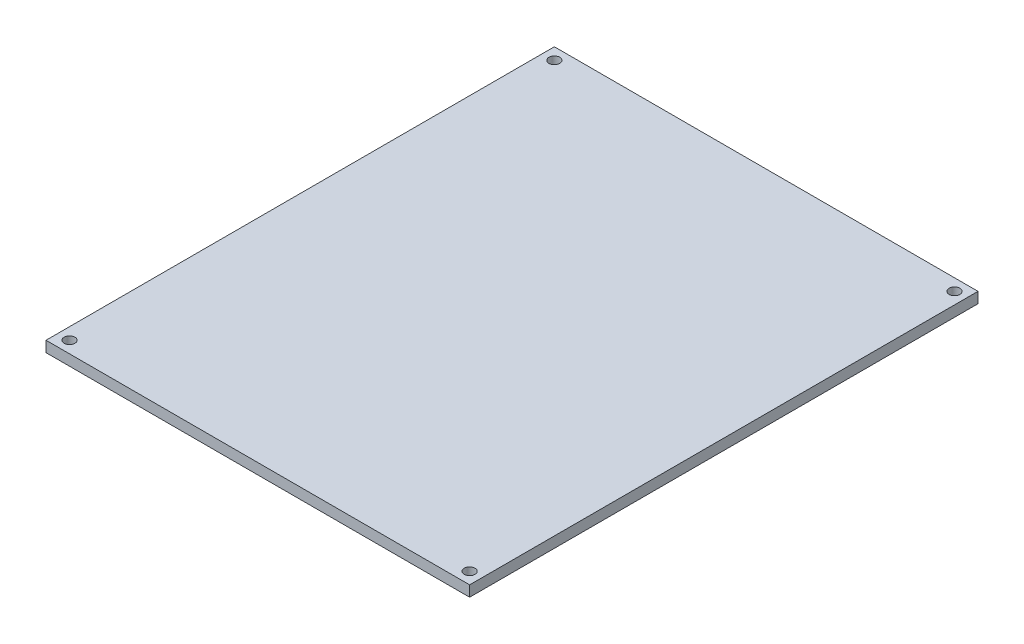
ISO-10303-21;
HEADER;
FILE_DESCRIPTION(('STEP AP214'),'2;1');
FILE_NAME('part.step','',(''),(''),'','','');
FILE_SCHEMA(('AUTOMOTIVE_DESIGN { 1 0 10303 214 1 1 1 1 }'));
ENDSEC;
DATA;
#1=APPLICATION_CONTEXT('core data for automotive mechanical design processes');
#2=APPLICATION_PROTOCOL_DEFINITION('international standard','automotive_design',2000,#1);
#3=PRODUCT_CONTEXT('',#1,'mechanical');
#4=PRODUCT('Part','Part','',(#3));
#5=PRODUCT_RELATED_PRODUCT_CATEGORY('part','',(#4));
#6=PRODUCT_DEFINITION_FORMATION('','',#4);
#7=PRODUCT_DEFINITION_CONTEXT('part definition',#1,'design');
#8=PRODUCT_DEFINITION('design','',#6,#7);
#9=PRODUCT_DEFINITION_SHAPE('','',#8);
#10=(LENGTH_UNIT() NAMED_UNIT(*) SI_UNIT(.MILLI.,.METRE.));
#11=(NAMED_UNIT(*) PLANE_ANGLE_UNIT() SI_UNIT($,.RADIAN.));
#12=(NAMED_UNIT(*) SI_UNIT($,.STERADIAN.) SOLID_ANGLE_UNIT());
#13=UNCERTAINTY_MEASURE_WITH_UNIT(LENGTH_MEASURE(1.E-05),#10,'distance_accuracy_value','');
#14=(GEOMETRIC_REPRESENTATION_CONTEXT(3) GLOBAL_UNCERTAINTY_ASSIGNED_CONTEXT((#13)) GLOBAL_UNIT_ASSIGNED_CONTEXT((#10,
#11,#12)) REPRESENTATION_CONTEXT('',''));
#15=CARTESIAN_POINT('',(0.,0.,0.));
#16=DIRECTION('',(0.,0.,1.));
#17=DIRECTION('',(1.,0.,0.));
#18=AXIS2_PLACEMENT_3D('',#15,#16,#17);
#19=CARTESIAN_POINT('',(0.,2.54,0.));
#20=DIRECTION('',(1.,0.,0.));
#21=DIRECTION('',(0.,0.,-1.));
#22=AXIS2_PLACEMENT_3D('',#19,#20,#21);
#23=PLANE('',#22);
#24=DIRECTION('',(0.,0.,1.));
#25=VECTOR('',#24,1.);
#26=CARTESIAN_POINT('',(0.,0.,0.));
#27=LINE('',#26,#25);
#28=CARTESIAN_POINT('',(0.,0.,-120.));
#29=VERTEX_POINT('',#28);
#30=CARTESIAN_POINT('',(0.,0.,0.));
#31=VERTEX_POINT('',#30);
#32=EDGE_CURVE('E107',#29,#31,#27,.T.);
#33=ORIENTED_EDGE('',*,*,#32,.T.);
#34=DIRECTION('',(0.,-1.,0.));
#35=VECTOR('',#34,1.);
#36=CARTESIAN_POINT('',(0.,2.54,0.));
#37=LINE('',#36,#35);
#38=CARTESIAN_POINT('',(0.,2.54,0.));
#39=VERTEX_POINT('',#38);
#40=EDGE_CURVE('E11',#39,#31,#37,.T.);
#41=ORIENTED_EDGE('',*,*,#40,.F.);
#42=DIRECTION('',(0.,0.,1.));
#43=VECTOR('',#42,1.);
#44=CARTESIAN_POINT('',(0.,2.54,0.));
#45=LINE('',#44,#43);
#46=CARTESIAN_POINT('',(0.,2.54,-120.));
#47=VERTEX_POINT('',#46);
#48=EDGE_CURVE('E91',#47,#39,#45,.T.);
#49=ORIENTED_EDGE('',*,*,#48,.F.);
#50=DIRECTION('',(0.,-1.,0.));
#51=VECTOR('',#50,1.);
#52=CARTESIAN_POINT('',(0.,2.54,-120.));
#53=LINE('',#52,#51);
#54=EDGE_CURVE('E103',#47,#29,#53,.T.);
#55=ORIENTED_EDGE('',*,*,#54,.T.);
#56=EDGE_LOOP('',(#33,#41,#49,#55));
#57=FACE_BOUND('',#56,.T.);
#58=ADVANCED_FACE('F39',(#57),#23,.F.);
#59=CARTESIAN_POINT('',(0.,2.54,0.));
#60=DIRECTION('',(0.,0.,-1.));
#61=DIRECTION('',(-1.,0.,0.));
#62=AXIS2_PLACEMENT_3D('',#59,#60,#61);
#63=PLANE('',#62);
#64=DIRECTION('',(1.,0.,0.));
#65=VECTOR('',#64,1.);
#66=CARTESIAN_POINT('',(0.,0.,0.));
#67=LINE('',#66,#65);
#68=CARTESIAN_POINT('',(100.,0.,0.));
#69=VERTEX_POINT('',#68);
#70=EDGE_CURVE('E96',#31,#69,#67,.T.);
#71=ORIENTED_EDGE('',*,*,#70,.T.);
#72=DIRECTION('',(0.,-1.,0.));
#73=VECTOR('',#72,1.);
#74=CARTESIAN_POINT('',(100.,2.54,0.));
#75=LINE('',#74,#73);
#76=CARTESIAN_POINT('',(100.,2.54,0.));
#77=VERTEX_POINT('',#76);
#78=EDGE_CURVE('E48',#77,#69,#75,.T.);
#79=ORIENTED_EDGE('',*,*,#78,.F.);
#80=DIRECTION('',(1.,0.,0.));
#81=VECTOR('',#80,1.);
#82=CARTESIAN_POINT('',(0.,2.54,0.));
#83=LINE('',#82,#81);
#84=EDGE_CURVE('E86',#39,#77,#83,.T.);
#85=ORIENTED_EDGE('',*,*,#84,.F.);
#86=ORIENTED_EDGE('',*,*,#40,.T.);
#87=EDGE_LOOP('',(#71,#79,#85,#86));
#88=FACE_BOUND('',#87,.T.);
#89=ADVANCED_FACE('F95',(#88),#63,.F.);
#90=CARTESIAN_POINT('',(100.,2.54,0.));
#91=DIRECTION('',(-1.,0.,0.));
#92=DIRECTION('',(0.,0.,1.));
#93=AXIS2_PLACEMENT_3D('',#90,#91,#92);
#94=PLANE('',#93);
#95=DIRECTION('',(0.,0.,-1.));
#96=VECTOR('',#95,1.);
#97=CARTESIAN_POINT('',(100.,0.,0.));
#98=LINE('',#97,#96);
#99=CARTESIAN_POINT('',(100.,0.,-120.));
#100=VERTEX_POINT('',#99);
#101=EDGE_CURVE('E73',#69,#100,#98,.T.);
#102=ORIENTED_EDGE('',*,*,#101,.T.);
#103=DIRECTION('',(0.,-1.,0.));
#104=VECTOR('',#103,1.);
#105=CARTESIAN_POINT('',(100.,2.54,-120.));
#106=LINE('',#105,#104);
#107=CARTESIAN_POINT('',(100.,2.54,-120.));
#108=VERTEX_POINT('',#107);
#109=EDGE_CURVE('E98',#108,#100,#106,.T.);
#110=ORIENTED_EDGE('',*,*,#109,.F.);
#111=DIRECTION('',(0.,0.,-1.));
#112=VECTOR('',#111,1.);
#113=CARTESIAN_POINT('',(100.,2.54,0.));
#114=LINE('',#113,#112);
#115=EDGE_CURVE('E89',#77,#108,#114,.T.);
#116=ORIENTED_EDGE('',*,*,#115,.F.);
#117=ORIENTED_EDGE('',*,*,#78,.T.);
#118=EDGE_LOOP('',(#102,#110,#116,#117));
#119=FACE_BOUND('',#118,.T.);
#120=ADVANCED_FACE('F99',(#119),#94,.F.);
#121=CARTESIAN_POINT('',(0.,2.54,-120.));
#122=DIRECTION('',(0.,0.,1.));
#123=DIRECTION('',(1.,0.,0.));
#124=AXIS2_PLACEMENT_3D('',#121,#122,#123);
#125=PLANE('',#124);
#126=DIRECTION('',(-1.,0.,0.));
#127=VECTOR('',#126,1.);
#128=CARTESIAN_POINT('',(0.,0.,-120.));
#129=LINE('',#128,#127);
#130=EDGE_CURVE('E79',#100,#29,#129,.T.);
#131=ORIENTED_EDGE('',*,*,#130,.T.);
#132=ORIENTED_EDGE('',*,*,#54,.F.);
#133=DIRECTION('',(-1.,0.,0.));
#134=VECTOR('',#133,1.);
#135=CARTESIAN_POINT('',(0.,2.54,-120.));
#136=LINE('',#135,#134);
#137=EDGE_CURVE('E56',#108,#47,#136,.T.);
#138=ORIENTED_EDGE('',*,*,#137,.F.);
#139=ORIENTED_EDGE('',*,*,#109,.T.);
#140=EDGE_LOOP('',(#131,#132,#138,#139));
#141=FACE_BOUND('',#140,.T.);
#142=ADVANCED_FACE('F121',(#141),#125,.F.);
#143=CARTESIAN_POINT('',(0.,2.54,0.));
#144=DIRECTION('',(0.,-1.,0.));
#145=DIRECTION('',(0.,0.,-1.));
#146=AXIS2_PLACEMENT_3D('',#143,#144,#145);
#147=PLANE('',#146);
#148=CARTESIAN_POINT('',(2.77446153768,2.54,-2.77446153768));
#149=DIRECTION('',(0.,1.,0.));
#150=DIRECTION('',(0.,0.,1.));
#151=AXIS2_PLACEMENT_3D('',#148,#149,#150);
#152=CIRCLE('',#151,1.27);
#153=CARTESIAN_POINT('',(2.77446153768,2.54,-1.50446153768));
#154=VERTEX_POINT('',#153);
#155=EDGE_CURVE('E136',#154,#154,#152,.T.);
#156=ORIENTED_EDGE('',*,*,#155,.F.);
#157=EDGE_LOOP('',(#156));
#158=FACE_BOUND('',#157,.T.);
#159=CARTESIAN_POINT('',(97.22553846232,2.54,-2.77446153768));
#160=DIRECTION('',(0.,1.,0.));
#161=DIRECTION('',(0.,0.,1.));
#162=AXIS2_PLACEMENT_3D('',#159,#160,#161);
#163=CIRCLE('',#162,1.26999999999999);
#164=CARTESIAN_POINT('',(97.22553846232,2.54,-1.50446153768001));
#165=VERTEX_POINT('',#164);
#166=EDGE_CURVE('E144',#165,#165,#163,.T.);
#167=ORIENTED_EDGE('',*,*,#166,.F.);
#168=EDGE_LOOP('',(#167));
#169=FACE_BOUND('',#168,.T.);
#170=CARTESIAN_POINT('',(97.22553846232,2.54,-117.22553846232));
#171=DIRECTION('',(0.,1.,0.));
#172=DIRECTION('',(0.,0.,1.));
#173=AXIS2_PLACEMENT_3D('',#170,#171,#172);
#174=CIRCLE('',#173,1.26999999999999);
#175=CARTESIAN_POINT('',(97.22553846232,2.54,-115.95553846232));
#176=VERTEX_POINT('',#175);
#177=EDGE_CURVE('E152',#176,#176,#174,.T.);
#178=ORIENTED_EDGE('',*,*,#177,.F.);
#179=EDGE_LOOP('',(#178));
#180=FACE_BOUND('',#179,.T.);
#181=CARTESIAN_POINT('',(2.77446153768,2.54,-117.22553846232));
#182=DIRECTION('',(0.,1.,0.));
#183=DIRECTION('',(0.,0.,1.));
#184=AXIS2_PLACEMENT_3D('',#181,#182,#183);
#185=CIRCLE('',#184,1.27);
#186=CARTESIAN_POINT('',(2.77446153768,2.54,-115.95553846232));
#187=VERTEX_POINT('',#186);
#188=EDGE_CURVE('E128',#187,#187,#185,.T.);
#189=ORIENTED_EDGE('',*,*,#188,.F.);
#190=EDGE_LOOP('',(#189));
#191=FACE_BOUND('',#190,.T.);
#192=ORIENTED_EDGE('',*,*,#48,.T.);
#193=ORIENTED_EDGE('',*,*,#84,.T.);
#194=ORIENTED_EDGE('',*,*,#115,.T.);
#195=ORIENTED_EDGE('',*,*,#137,.T.);
#196=EDGE_LOOP('',(#192,#193,#194,#195));
#197=FACE_BOUND('',#196,.T.);
#198=ADVANCED_FACE('F87',(#158,#169,#180,#191,#197),#147,.F.);
#199=CARTESIAN_POINT('',(0.,0.,0.));
#200=DIRECTION('',(0.,-1.,0.));
#201=DIRECTION('',(0.,0.,-1.));
#202=AXIS2_PLACEMENT_3D('',#199,#200,#201);
#203=PLANE('',#202);
#204=CARTESIAN_POINT('',(2.77446153768,0.,-2.77446153768));
#205=DIRECTION('',(0.,1.,0.));
#206=DIRECTION('',(0.,0.,1.));
#207=AXIS2_PLACEMENT_3D('',#204,#205,#206);
#208=CIRCLE('',#207,1.27);
#209=CARTESIAN_POINT('',(2.77446153768,0.,-1.50446153768));
#210=VERTEX_POINT('',#209);
#211=EDGE_CURVE('E140',#210,#210,#208,.T.);
#212=ORIENTED_EDGE('',*,*,#211,.T.);
#213=EDGE_LOOP('',(#212));
#214=FACE_BOUND('',#213,.T.);
#215=CARTESIAN_POINT('',(97.22553846232,0.,-2.77446153768));
#216=DIRECTION('',(0.,1.,0.));
#217=DIRECTION('',(0.,0.,1.));
#218=AXIS2_PLACEMENT_3D('',#215,#216,#217);
#219=CIRCLE('',#218,1.26999999999999);
#220=CARTESIAN_POINT('',(97.22553846232,0.,-1.50446153768001));
#221=VERTEX_POINT('',#220);
#222=EDGE_CURVE('E148',#221,#221,#219,.T.);
#223=ORIENTED_EDGE('',*,*,#222,.T.);
#224=EDGE_LOOP('',(#223));
#225=FACE_BOUND('',#224,.T.);
#226=CARTESIAN_POINT('',(97.22553846232,0.,-117.22553846232));
#227=DIRECTION('',(0.,1.,0.));
#228=DIRECTION('',(0.,0.,1.));
#229=AXIS2_PLACEMENT_3D('',#226,#227,#228);
#230=CIRCLE('',#229,1.26999999999999);
#231=CARTESIAN_POINT('',(97.22553846232,0.,-115.95553846232));
#232=VERTEX_POINT('',#231);
#233=EDGE_CURVE('E132',#232,#232,#230,.T.);
#234=ORIENTED_EDGE('',*,*,#233,.T.);
#235=EDGE_LOOP('',(#234));
#236=FACE_BOUND('',#235,.T.);
#237=CARTESIAN_POINT('',(2.77446153768,0.,-117.22553846232));
#238=DIRECTION('',(0.,1.,0.));
#239=DIRECTION('',(0.,0.,1.));
#240=AXIS2_PLACEMENT_3D('',#237,#238,#239);
#241=CIRCLE('',#240,1.27);
#242=CARTESIAN_POINT('',(2.77446153768,0.,-115.95553846232));
#243=VERTEX_POINT('',#242);
#244=EDGE_CURVE('E111',#243,#243,#241,.T.);
#245=ORIENTED_EDGE('',*,*,#244,.T.);
#246=EDGE_LOOP('',(#245));
#247=FACE_BOUND('',#246,.T.);
#248=ORIENTED_EDGE('',*,*,#32,.F.);
#249=ORIENTED_EDGE('',*,*,#130,.F.);
#250=ORIENTED_EDGE('',*,*,#101,.F.);
#251=ORIENTED_EDGE('',*,*,#70,.F.);
#252=EDGE_LOOP('',(#248,#249,#250,#251));
#253=FACE_BOUND('',#252,.T.);
#254=ADVANCED_FACE('F124',(#214,#225,#236,#247,#253),#203,.T.);
#255=CARTESIAN_POINT('',(2.77446153768,0.,-117.22553846232));
#256=DIRECTION('',(0.,1.,0.));
#257=DIRECTION('',(0.,0.,1.));
#258=AXIS2_PLACEMENT_3D('',#255,#256,#257);
#259=CYLINDRICAL_SURFACE('',#258,1.27);
#260=ORIENTED_EDGE('',*,*,#244,.F.);
#261=EDGE_LOOP('',(#260));
#262=FACE_BOUND('',#261,.T.);
#263=ORIENTED_EDGE('',*,*,#188,.T.);
#264=EDGE_LOOP('',(#263));
#265=FACE_BOUND('',#264,.T.);
#266=ADVANCED_FACE('F166',(#262,#265),#259,.F.);
#267=CARTESIAN_POINT('',(97.22553846232,0.,-117.22553846232));
#268=DIRECTION('',(0.,1.,0.));
#269=DIRECTION('',(0.,0.,1.));
#270=AXIS2_PLACEMENT_3D('',#267,#268,#269);
#271=CYLINDRICAL_SURFACE('',#270,1.26999999999999);
#272=ORIENTED_EDGE('',*,*,#233,.F.);
#273=EDGE_LOOP('',(#272));
#274=FACE_BOUND('',#273,.T.);
#275=ORIENTED_EDGE('',*,*,#177,.T.);
#276=EDGE_LOOP('',(#275));
#277=FACE_BOUND('',#276,.T.);
#278=ADVANCED_FACE('F162',(#274,#277),#271,.F.);
#279=CARTESIAN_POINT('',(97.22553846232,0.,-2.77446153768));
#280=DIRECTION('',(0.,1.,0.));
#281=DIRECTION('',(0.,0.,1.));
#282=AXIS2_PLACEMENT_3D('',#279,#280,#281);
#283=CYLINDRICAL_SURFACE('',#282,1.26999999999999);
#284=ORIENTED_EDGE('',*,*,#222,.F.);
#285=EDGE_LOOP('',(#284));
#286=FACE_BOUND('',#285,.T.);
#287=ORIENTED_EDGE('',*,*,#166,.T.);
#288=EDGE_LOOP('',(#287));
#289=FACE_BOUND('',#288,.T.);
#290=ADVANCED_FACE('F165',(#286,#289),#283,.F.);
#291=CARTESIAN_POINT('',(2.77446153768,0.,-2.77446153768));
#292=DIRECTION('',(0.,1.,0.));
#293=DIRECTION('',(0.,0.,1.));
#294=AXIS2_PLACEMENT_3D('',#291,#292,#293);
#295=CYLINDRICAL_SURFACE('',#294,1.27);
#296=ORIENTED_EDGE('',*,*,#211,.F.);
#297=EDGE_LOOP('',(#296));
#298=FACE_BOUND('',#297,.T.);
#299=ORIENTED_EDGE('',*,*,#155,.T.);
#300=EDGE_LOOP('',(#299));
#301=FACE_BOUND('',#300,.T.);
#302=ADVANCED_FACE('F227',(#298,#301),#295,.F.);
#303=CLOSED_SHELL('',(#58,#89,#120,#142,#198,#254,#266,#278,#290,#302));
#304=MANIFOLD_SOLID_BREP('B2',#303);
#305=ADVANCED_BREP_SHAPE_REPRESENTATION('',(#18,#304),#14);
#306=SHAPE_DEFINITION_REPRESENTATION(#9,#305);
ENDSEC;
END-ISO-10303-21;
